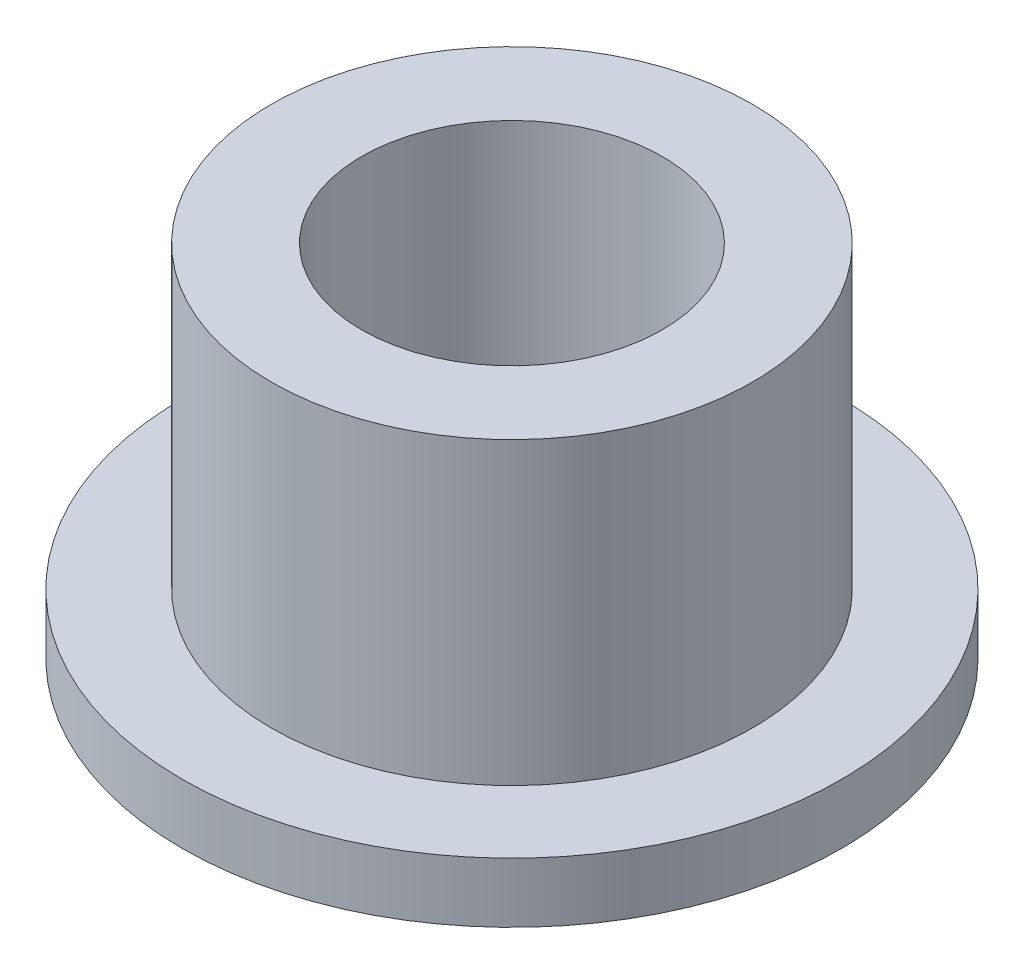
ISO-10303-21;
HEADER;
FILE_DESCRIPTION(('STEP AP214'),'2;1');
FILE_NAME('part.step','',(''),(''),'','','');
FILE_SCHEMA(('AUTOMOTIVE_DESIGN { 1 0 10303 214 1 1 1 1 }'));
ENDSEC;
DATA;
#1=APPLICATION_CONTEXT('core data for automotive mechanical design processes');
#2=APPLICATION_PROTOCOL_DEFINITION('international standard','automotive_design',2000,#1);
#3=PRODUCT_CONTEXT('',#1,'mechanical');
#4=PRODUCT('Part','Part','',(#3));
#5=PRODUCT_RELATED_PRODUCT_CATEGORY('part','',(#4));
#6=PRODUCT_DEFINITION_FORMATION('','',#4);
#7=PRODUCT_DEFINITION_CONTEXT('part definition',#1,'design');
#8=PRODUCT_DEFINITION('design','',#6,#7);
#9=PRODUCT_DEFINITION_SHAPE('','',#8);
#10=(LENGTH_UNIT() NAMED_UNIT(*) SI_UNIT(.MILLI.,.METRE.));
#11=(NAMED_UNIT(*) PLANE_ANGLE_UNIT() SI_UNIT($,.RADIAN.));
#12=(NAMED_UNIT(*) SI_UNIT($,.STERADIAN.) SOLID_ANGLE_UNIT());
#13=UNCERTAINTY_MEASURE_WITH_UNIT(LENGTH_MEASURE(1.E-05),#10,'distance_accuracy_value','');
#14=(GEOMETRIC_REPRESENTATION_CONTEXT(3) GLOBAL_UNCERTAINTY_ASSIGNED_CONTEXT((#13)) GLOBAL_UNIT_ASSIGNED_CONTEXT((#10,
#11,#12)) REPRESENTATION_CONTEXT('',''));
#15=CARTESIAN_POINT('',(0.,0.,0.));
#16=DIRECTION('',(0.,0.,1.));
#17=DIRECTION('',(1.,0.,0.));
#18=AXIS2_PLACEMENT_3D('',#15,#16,#17);
#19=CARTESIAN_POINT('',(0.,9.525,0.));
#20=DIRECTION('',(0.,1.,0.));
#21=DIRECTION('',(0.,0.,1.));
#22=AXIS2_PLACEMENT_3D('',#19,#20,#21);
#23=PLANE('',#22);
#24=CARTESIAN_POINT('',(0.,9.525,0.));
#25=DIRECTION('',(0.,1.,0.));
#26=DIRECTION('',(0.,0.,1.));
#27=AXIS2_PLACEMENT_3D('',#24,#25,#26);
#28=CIRCLE('',#27,6.3754);
#29=CARTESIAN_POINT('',(0.,9.525,6.3754));
#30=VERTEX_POINT('',#29);
#31=EDGE_CURVE('E10',#30,#30,#28,.T.);
#32=ORIENTED_EDGE('',*,*,#31,.T.);
#33=EDGE_LOOP('',(#32));
#34=FACE_BOUND('',#33,.T.);
#35=CARTESIAN_POINT('',(0.,9.525,0.));
#36=DIRECTION('',(0.,1.,0.));
#37=DIRECTION('',(0.,0.,1.));
#38=AXIS2_PLACEMENT_3D('',#35,#36,#37);
#39=CIRCLE('',#38,3.98145);
#40=CARTESIAN_POINT('',(0.,9.525,3.98145));
#41=VERTEX_POINT('',#40);
#42=EDGE_CURVE('E37',#41,#41,#39,.T.);
#43=ORIENTED_EDGE('',*,*,#42,.F.);
#44=EDGE_LOOP('',(#43));
#45=FACE_BOUND('',#44,.T.);
#46=ADVANCED_FACE('F30',(#34,#45),#23,.T.);
#47=CARTESIAN_POINT('',(0.,0.,0.));
#48=DIRECTION('',(0.,1.,0.));
#49=DIRECTION('',(0.,0.,1.));
#50=AXIS2_PLACEMENT_3D('',#47,#48,#49);
#51=PLANE('',#50);
#52=CARTESIAN_POINT('',(0.,0.,0.));
#53=DIRECTION('',(0.,1.,0.));
#54=DIRECTION('',(0.,0.,1.));
#55=AXIS2_PLACEMENT_3D('',#52,#53,#54);
#56=CIRCLE('',#55,3.98145);
#57=CARTESIAN_POINT('',(0.,0.,3.98145));
#58=VERTEX_POINT('',#57);
#59=EDGE_CURVE('E41',#58,#58,#56,.T.);
#60=ORIENTED_EDGE('',*,*,#59,.T.);
#61=EDGE_LOOP('',(#60));
#62=FACE_BOUND('',#61,.T.);
#63=CARTESIAN_POINT('',(0.,0.,0.));
#64=DIRECTION('',(0.,1.,0.));
#65=DIRECTION('',(0.,0.,1.));
#66=AXIS2_PLACEMENT_3D('',#63,#64,#65);
#67=CIRCLE('',#66,8.73125);
#68=CARTESIAN_POINT('',(0.,0.,8.73125));
#69=VERTEX_POINT('',#68);
#70=EDGE_CURVE('E48',#69,#69,#67,.T.);
#71=ORIENTED_EDGE('',*,*,#70,.F.);
#72=EDGE_LOOP('',(#71));
#73=FACE_BOUND('',#72,.T.);
#74=ADVANCED_FACE('F73',(#62,#73),#51,.F.);
#75=CARTESIAN_POINT('',(0.,9.525,0.));
#76=DIRECTION('',(0.,-1.,0.));
#77=DIRECTION('',(0.,0.,-1.));
#78=AXIS2_PLACEMENT_3D('',#75,#76,#77);
#79=CYLINDRICAL_SURFACE('',#78,6.3754);
#80=CARTESIAN_POINT('',(0.,1.5875,0.));
#81=DIRECTION('',(0.,1.,0.));
#82=DIRECTION('',(0.,0.,1.));
#83=AXIS2_PLACEMENT_3D('',#80,#81,#82);
#84=CIRCLE('',#83,6.3754);
#85=CARTESIAN_POINT('',(0.,1.5875,6.3754));
#86=VERTEX_POINT('',#85);
#87=EDGE_CURVE('E51',#86,#86,#84,.T.);
#88=ORIENTED_EDGE('',*,*,#87,.T.);
#89=EDGE_LOOP('',(#88));
#90=FACE_BOUND('',#89,.T.);
#91=ORIENTED_EDGE('',*,*,#31,.F.);
#92=EDGE_LOOP('',(#91));
#93=FACE_BOUND('',#92,.T.);
#94=ADVANCED_FACE('F32',(#90,#93),#79,.T.);
#95=CARTESIAN_POINT('',(0.,9.525,0.));
#96=DIRECTION('',(0.,-1.,0.));
#97=DIRECTION('',(0.,0.,-1.));
#98=AXIS2_PLACEMENT_3D('',#95,#96,#97);
#99=CYLINDRICAL_SURFACE('',#98,3.98145);
#100=ORIENTED_EDGE('',*,*,#42,.T.);
#101=EDGE_LOOP('',(#100));
#102=FACE_BOUND('',#101,.T.);
#103=ORIENTED_EDGE('',*,*,#59,.F.);
#104=EDGE_LOOP('',(#103));
#105=FACE_BOUND('',#104,.T.);
#106=ADVANCED_FACE('F62',(#102,#105),#99,.F.);
#107=CARTESIAN_POINT('',(0.,1.5875,0.));
#108=DIRECTION('',(0.,1.,0.));
#109=DIRECTION('',(0.,0.,1.));
#110=AXIS2_PLACEMENT_3D('',#107,#108,#109);
#111=PLANE('',#110);
#112=CARTESIAN_POINT('',(0.,1.5875,0.));
#113=DIRECTION('',(0.,1.,0.));
#114=DIRECTION('',(0.,0.,1.));
#115=AXIS2_PLACEMENT_3D('',#112,#113,#114);
#116=CIRCLE('',#115,8.73125);
#117=CARTESIAN_POINT('',(0.,1.5875,8.73125));
#118=VERTEX_POINT('',#117);
#119=EDGE_CURVE('E46',#118,#118,#116,.T.);
#120=ORIENTED_EDGE('',*,*,#119,.T.);
#121=EDGE_LOOP('',(#120));
#122=FACE_BOUND('',#121,.T.);
#123=ORIENTED_EDGE('',*,*,#87,.F.);
#124=EDGE_LOOP('',(#123));
#125=FACE_BOUND('',#124,.T.);
#126=ADVANCED_FACE('F59',(#122,#125),#111,.T.);
#127=CARTESIAN_POINT('',(0.,1.5875,0.));
#128=DIRECTION('',(0.,-1.,0.));
#129=DIRECTION('',(0.,0.,-1.));
#130=AXIS2_PLACEMENT_3D('',#127,#128,#129);
#131=CYLINDRICAL_SURFACE('',#130,8.73125);
#132=ORIENTED_EDGE('',*,*,#119,.F.);
#133=EDGE_LOOP('',(#132));
#134=FACE_BOUND('',#133,.T.);
#135=ORIENTED_EDGE('',*,*,#70,.T.);
#136=EDGE_LOOP('',(#135));
#137=FACE_BOUND('',#136,.T.);
#138=ADVANCED_FACE('F61',(#134,#137),#131,.T.);
#139=CLOSED_SHELL('',(#46,#74,#94,#106,#126,#138));
#140=MANIFOLD_SOLID_BREP('B2',#139);
#141=ADVANCED_BREP_SHAPE_REPRESENTATION('',(#18,#140),#14);
#142=SHAPE_DEFINITION_REPRESENTATION(#9,#141);
ENDSEC;
END-ISO-10303-21;
